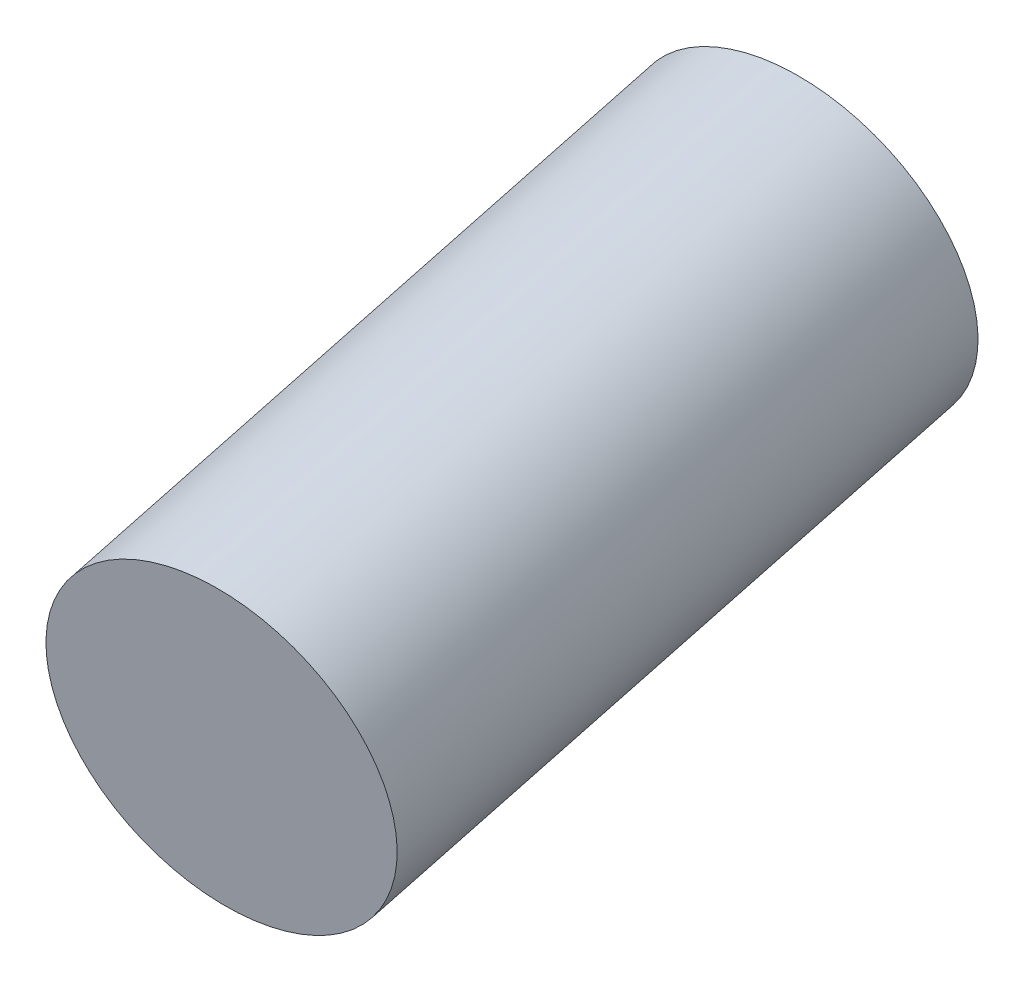
ISO-10303-21;
HEADER;
FILE_DESCRIPTION(('STEP AP214'),'2;1');
FILE_NAME('part.step','',(''),(''),'','','');
FILE_SCHEMA(('AUTOMOTIVE_DESIGN { 1 0 10303 214 1 1 1 1 }'));
ENDSEC;
DATA;
#1=APPLICATION_CONTEXT('core data for automotive mechanical design processes');
#2=APPLICATION_PROTOCOL_DEFINITION('international standard','automotive_design',2000,#1);
#3=PRODUCT_CONTEXT('',#1,'mechanical');
#4=PRODUCT('Part','Part','',(#3));
#5=PRODUCT_RELATED_PRODUCT_CATEGORY('part','',(#4));
#6=PRODUCT_DEFINITION_FORMATION('','',#4);
#7=PRODUCT_DEFINITION_CONTEXT('part definition',#1,'design');
#8=PRODUCT_DEFINITION('design','',#6,#7);
#9=PRODUCT_DEFINITION_SHAPE('','',#8);
#10=(LENGTH_UNIT() NAMED_UNIT(*) SI_UNIT(.MILLI.,.METRE.));
#11=(NAMED_UNIT(*) PLANE_ANGLE_UNIT() SI_UNIT($,.RADIAN.));
#12=(NAMED_UNIT(*) SI_UNIT($,.STERADIAN.) SOLID_ANGLE_UNIT());
#13=UNCERTAINTY_MEASURE_WITH_UNIT(LENGTH_MEASURE(1.E-05),#10,'distance_accuracy_value','');
#14=(GEOMETRIC_REPRESENTATION_CONTEXT(3) GLOBAL_UNCERTAINTY_ASSIGNED_CONTEXT((#13)) GLOBAL_UNIT_ASSIGNED_CONTEXT((#10,
#11,#12)) REPRESENTATION_CONTEXT('',''));
#15=CARTESIAN_POINT('',(0.,0.,0.));
#16=DIRECTION('',(0.,0.,1.));
#17=DIRECTION('',(1.,0.,0.));
#18=AXIS2_PLACEMENT_3D('',#15,#16,#17);
#19=CARTESIAN_POINT('',(-5.5578421519101,9.62646498755652,4.48352085995661));
#20=DIRECTION('',(-0.0868240888334618,0.150383733180434,-0.984807753012209));
#21=DIRECTION('',(-0.492403876506093,0.85286853195245,0.173648177666928));
#22=AXIS2_PLACEMENT_3D('',#19,#20,#21);
#23=PLANE('',#22);
#24=CARTESIAN_POINT('',(-5.5578421519101,9.62646498755652,4.48352085995661));
#25=DIRECTION('',(0.0868240888334618,-0.150383733180434,0.984807753012209));
#26=DIRECTION('',(0.492403876506093,-0.85286853195245,-0.173648177666927));
#27=AXIS2_PLACEMENT_3D('',#24,#25,#26);
#28=CIRCLE('',#27,1.93220030269667);
#29=CARTESIAN_POINT('',(-4.60641923267601,7.97855215195753,4.14799779850585));
#30=VERTEX_POINT('',#29);
#31=EDGE_CURVE('E10',#30,#30,#28,.T.);
#32=ORIENTED_EDGE('',*,*,#31,.T.);
#33=EDGE_LOOP('',(#32));
#34=FACE_BOUND('',#33,.T.);
#35=ADVANCED_FACE('F15',(#34),#23,.F.);
#36=CARTESIAN_POINT('',(-5.46326660671918,9.46265533813232,5.55625000000001));
#37=DIRECTION('',(0.0868240888334618,-0.150383733180434,0.984807753012209));
#38=DIRECTION('',(0.492403876506093,-0.85286853195245,-0.173648177666928));
#39=AXIS2_PLACEMENT_3D('',#36,#37,#38);
#40=CYLINDRICAL_SURFACE('',#39,1.93220030269667);
#41=ORIENTED_EDGE('',*,*,#31,.F.);
#42=EDGE_LOOP('',(#41));
#43=FACE_BOUND('',#42,.T.);
#44=CARTESIAN_POINT('',(-6.23304408187455,10.7959490356235,-3.175));
#45=DIRECTION('',(0.0868240888334618,-0.150383733180434,0.984807753012209));
#46=DIRECTION('',(0.492403876506094,-0.85286853195245,-0.173648177666927));
#47=AXIS2_PLACEMENT_3D('',#44,#45,#46);
#48=CIRCLE('',#47,1.93220030269668);
#49=CARTESIAN_POINT('',(-5.28162116264046,9.1480362000245,-3.51052306145076));
#50=VERTEX_POINT('',#49);
#51=EDGE_CURVE('E19',#50,#50,#48,.T.);
#52=ORIENTED_EDGE('',*,*,#51,.T.);
#53=EDGE_LOOP('',(#52));
#54=FACE_BOUND('',#53,.T.);
#55=ADVANCED_FACE('F28',(#43,#54),#40,.T.);
#56=CARTESIAN_POINT('',(-7.18446700110864,12.4438618712225,-2.83947693854923));
#57=DIRECTION('',(0.0868240888334618,-0.150383733180434,0.984807753012209));
#58=DIRECTION('',(0.492403876506093,-0.85286853195245,-0.173648177666928));
#59=AXIS2_PLACEMENT_3D('',#56,#57,#58);
#60=PLANE('',#59);
#61=ORIENTED_EDGE('',*,*,#51,.F.);
#62=EDGE_LOOP('',(#61));
#63=FACE_BOUND('',#62,.T.);
#64=ADVANCED_FACE('F17',(#63),#60,.F.);
#65=CLOSED_SHELL('',(#35,#55,#64));
#66=MANIFOLD_SOLID_BREP('B1',#65);
#67=ADVANCED_BREP_SHAPE_REPRESENTATION('',(#18,#66),#14);
#68=SHAPE_DEFINITION_REPRESENTATION(#9,#67);
ENDSEC;
END-ISO-10303-21;
